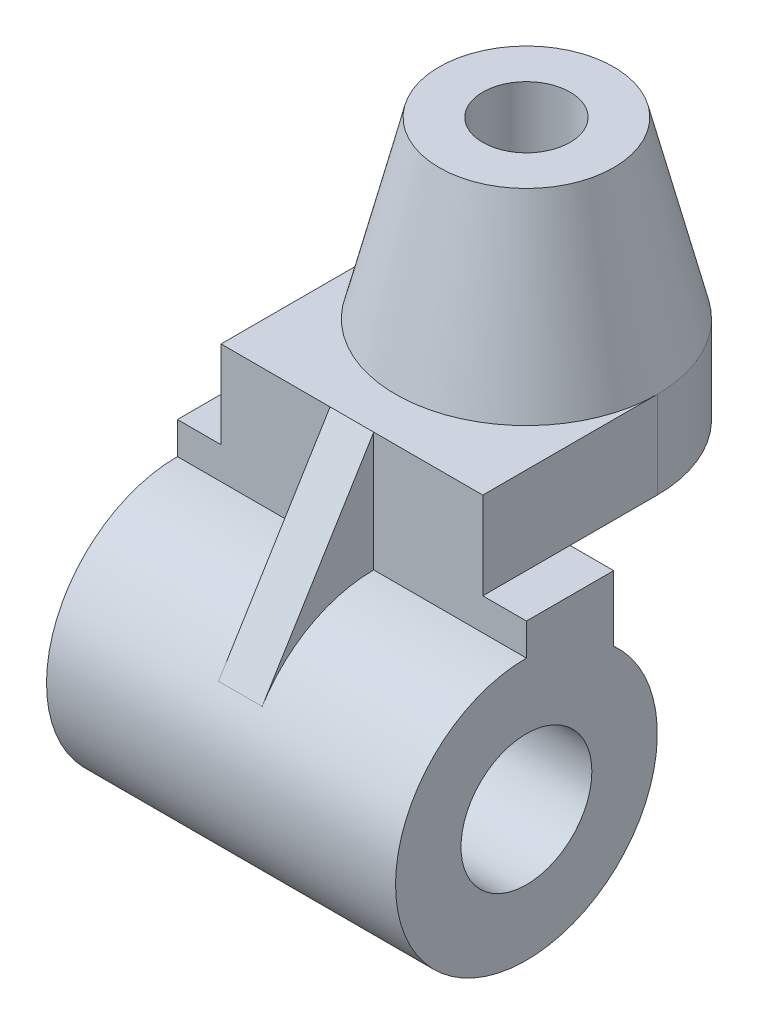
ISO-10303-21;
HEADER;
FILE_DESCRIPTION(('STEP AP214'),'2;1');
FILE_NAME('part.step','',(''),(''),'','','');
FILE_SCHEMA(('AUTOMOTIVE_DESIGN { 1 0 10303 214 1 1 1 1 }'));
ENDSEC;
DATA;
#1=APPLICATION_CONTEXT('core data for automotive mechanical design processes');
#2=APPLICATION_PROTOCOL_DEFINITION('international standard','automotive_design',2000,#1);
#3=PRODUCT_CONTEXT('',#1,'mechanical');
#4=PRODUCT('Part','Part','',(#3));
#5=PRODUCT_RELATED_PRODUCT_CATEGORY('part','',(#4));
#6=PRODUCT_DEFINITION_FORMATION('','',#4);
#7=PRODUCT_DEFINITION_CONTEXT('part definition',#1,'design');
#8=PRODUCT_DEFINITION('design','',#6,#7);
#9=PRODUCT_DEFINITION_SHAPE('','',#8);
#10=(LENGTH_UNIT() NAMED_UNIT(*) SI_UNIT(.MILLI.,.METRE.));
#11=(NAMED_UNIT(*) PLANE_ANGLE_UNIT() SI_UNIT($,.RADIAN.));
#12=(NAMED_UNIT(*) SI_UNIT($,.STERADIAN.) SOLID_ANGLE_UNIT());
#13=UNCERTAINTY_MEASURE_WITH_UNIT(LENGTH_MEASURE(1.E-05),#10,'distance_accuracy_value','');
#14=(GEOMETRIC_REPRESENTATION_CONTEXT(3) GLOBAL_UNCERTAINTY_ASSIGNED_CONTEXT((#13)) GLOBAL_UNIT_ASSIGNED_CONTEXT((#10,
#11,#12)) REPRESENTATION_CONTEXT('',''));
#15=CARTESIAN_POINT('',(0.,0.,0.));
#16=DIRECTION('',(0.,0.,1.));
#17=DIRECTION('',(1.,0.,0.));
#18=AXIS2_PLACEMENT_3D('',#15,#16,#17);
#19=CARTESIAN_POINT('',(0.,-60.,40.));
#20=DIRECTION('',(0.,0.,1.));
#21=DIRECTION('',(1.,0.,0.));
#22=AXIS2_PLACEMENT_3D('',#19,#20,#21);
#23=PLANE('',#22);
#24=DIRECTION('',(-1.,0.,0.));
#25=VECTOR('',#24,1.);
#26=CARTESIAN_POINT('',(40.,-67.3606797749979,40.));
#27=LINE('',#26,#25);
#28=CARTESIAN_POINT('',(-5.,-67.3606797749979,40.));
#29=VERTEX_POINT('',#28);
#30=CARTESIAN_POINT('',(-40.,-67.3606797749979,40.));
#31=VERTEX_POINT('',#30);
#32=EDGE_CURVE('E189',#29,#31,#27,.T.);
#33=ORIENTED_EDGE('',*,*,#32,.F.);
#34=DIRECTION('',(0.,1.,0.));
#35=VECTOR('',#34,1.);
#36=CARTESIAN_POINT('',(-5.,-60.,40.));
#37=LINE('',#36,#35);
#38=CARTESIAN_POINT('',(-5.,-40.,40.));
#39=VERTEX_POINT('',#38);
#40=EDGE_CURVE('E64',#29,#39,#37,.T.);
#41=ORIENTED_EDGE('',*,*,#40,.T.);
#42=DIRECTION('',(1.,0.,0.));
#43=VECTOR('',#42,1.);
#44=CARTESIAN_POINT('',(0.,-40.,40.));
#45=LINE('',#44,#43);
#46=CARTESIAN_POINT('',(-30.,-40.,40.));
#47=VERTEX_POINT('',#46);
#48=EDGE_CURVE('E215',#47,#39,#45,.T.);
#49=ORIENTED_EDGE('',*,*,#48,.F.);
#50=DIRECTION('',(0.,1.,0.));
#51=VECTOR('',#50,1.);
#52=CARTESIAN_POINT('',(-30.,-60.,40.));
#53=LINE('',#52,#51);
#54=CARTESIAN_POINT('',(-30.,-60.,40.));
#55=VERTEX_POINT('',#54);
#56=EDGE_CURVE('E224',#55,#47,#53,.T.);
#57=ORIENTED_EDGE('',*,*,#56,.F.);
#58=DIRECTION('',(-1.,0.,0.));
#59=VECTOR('',#58,1.);
#60=CARTESIAN_POINT('',(40.,-60.,40.));
#61=LINE('',#60,#59);
#62=CARTESIAN_POINT('',(-40.,-60.,40.));
#63=VERTEX_POINT('',#62);
#64=EDGE_CURVE('E192',#55,#63,#61,.T.);
#65=ORIENTED_EDGE('',*,*,#64,.T.);
#66=DIRECTION('',(0.,-1.,0.));
#67=VECTOR('',#66,1.);
#68=CARTESIAN_POINT('',(-40.,0.,40.));
#69=LINE('',#68,#67);
#70=EDGE_CURVE('E173',#63,#31,#69,.T.);
#71=ORIENTED_EDGE('',*,*,#70,.T.);
#72=EDGE_LOOP('',(#33,#41,#49,#57,#65,#71));
#73=FACE_BOUND('',#72,.T.);
#74=ADVANCED_FACE('F37',(#73),#23,.T.);
#75=CARTESIAN_POINT('',(0.,0.,0.));
#76=DIRECTION('',(0.,1.,0.));
#77=DIRECTION('',(0.,0.,1.));
#78=AXIS2_PLACEMENT_3D('',#75,#76,#77);
#79=PLANE('',#78);
#80=CARTESIAN_POINT('',(0.,0.,0.));
#81=DIRECTION('',(0.,1.,0.));
#82=DIRECTION('',(0.,0.,1.));
#83=AXIS2_PLACEMENT_3D('',#80,#81,#82);
#84=CIRCLE('',#83,10.);
#85=CARTESIAN_POINT('',(0.,0.,10.));
#86=VERTEX_POINT('',#85);
#87=EDGE_CURVE('E391',#86,#86,#84,.T.);
#88=ORIENTED_EDGE('',*,*,#87,.F.);
#89=EDGE_LOOP('',(#88));
#90=FACE_BOUND('',#89,.T.);
#91=CARTESIAN_POINT('',(0.,0.,0.));
#92=DIRECTION('',(0.,1.,0.));
#93=DIRECTION('',(0.,0.,1.));
#94=AXIS2_PLACEMENT_3D('',#91,#92,#93);
#95=CIRCLE('',#94,20.);
#96=CARTESIAN_POINT('',(0.,0.,20.));
#97=VERTEX_POINT('',#96);
#98=EDGE_CURVE('E42',#97,#97,#95,.T.);
#99=ORIENTED_EDGE('',*,*,#98,.T.);
#100=EDGE_LOOP('',(#99));
#101=FACE_BOUND('',#100,.T.);
#102=ADVANCED_FACE('F267',(#90,#101),#79,.T.);
#103=CARTESIAN_POINT('',(0.,0.,0.));
#104=DIRECTION('',(0.,-1.,0.));
#105=DIRECTION('',(0.,0.,-1.));
#106=AXIS2_PLACEMENT_3D('',#103,#104,#105);
#107=CONICAL_SURFACE('',#106,20.,0.244978663126864);
#108=CARTESIAN_POINT('',(0.,-40.,0.));
#109=DIRECTION('',(0.,1.,0.));
#110=DIRECTION('',(0.,0.,1.));
#111=AXIS2_PLACEMENT_3D('',#108,#109,#110);
#112=CIRCLE('',#111,30.);
#113=CARTESIAN_POINT('',(30.,-40.,0.000549099686691982));
#114=VERTEX_POINT('',#113);
#115=CARTESIAN_POINT('',(30.,-40.,0.));
#116=VERTEX_POINT('',#115);
#117=EDGE_CURVE('E234',#114,#116,#112,.T.);
#118=ORIENTED_EDGE('',*,*,#117,.T.);
#119=CARTESIAN_POINT('',(0.,-40.,0.));
#120=DIRECTION('',(0.,1.,0.));
#121=DIRECTION('',(0.,0.,1.));
#122=AXIS2_PLACEMENT_3D('',#119,#120,#121);
#123=CIRCLE('',#122,30.);
#124=CARTESIAN_POINT('',(-30.,-40.,0.));
#125=VERTEX_POINT('',#124);
#126=EDGE_CURVE('E202',#125,#116,#123,.F.);
#127=ORIENTED_EDGE('',*,*,#126,.F.);
#128=EDGE_CURVE('E238',#125,#114,#112,.T.);
#129=ORIENTED_EDGE('',*,*,#128,.T.);
#130=EDGE_LOOP('',(#118,#127,#129));
#131=FACE_BOUND('',#130,.T.);
#132=ORIENTED_EDGE('',*,*,#98,.F.);
#133=EDGE_LOOP('',(#132));
#134=FACE_BOUND('',#133,.T.);
#135=ADVANCED_FACE('F39',(#131,#134),#107,.T.);
#136=CARTESIAN_POINT('',(0.,-40.0001,0.));
#137=DIRECTION('',(0.,1.,0.));
#138=DIRECTION('',(0.,0.,1.));
#139=AXIS2_PLACEMENT_3D('',#136,#137,#138);
#140=CYLINDRICAL_SURFACE('',#139,10.);
#141=CARTESIAN_POINT('',(0.,-40.,0.));
#142=DIRECTION('',(0.,1.,0.));
#143=DIRECTION('',(0.,0.,1.));
#144=AXIS2_PLACEMENT_3D('',#141,#142,#143);
#145=CIRCLE('',#144,10.);
#146=CARTESIAN_POINT('',(0.,-40.,10.));
#147=VERTEX_POINT('',#146);
#148=EDGE_CURVE('E393',#147,#147,#145,.T.);
#149=ORIENTED_EDGE('',*,*,#148,.F.);
#150=EDGE_LOOP('',(#149));
#151=FACE_BOUND('',#150,.T.);
#152=ORIENTED_EDGE('',*,*,#87,.T.);
#153=EDGE_LOOP('',(#152));
#154=FACE_BOUND('',#153,.T.);
#155=ADVANCED_FACE('F277',(#151,#154),#140,.F.);
#156=CARTESIAN_POINT('',(0.,-40.,0.));
#157=DIRECTION('',(0.,1.,0.));
#158=DIRECTION('',(0.,0.,1.));
#159=AXIS2_PLACEMENT_3D('',#156,#157,#158);
#160=PLANE('',#159);
#161=ORIENTED_EDGE('',*,*,#148,.T.);
#162=EDGE_LOOP('',(#161));
#163=FACE_BOUND('',#162,.T.);
#164=ADVANCED_FACE('F280',(#163),#160,.T.);
#165=CARTESIAN_POINT('',(0.,-60.,0.));
#166=DIRECTION('',(0.,1.,0.));
#167=DIRECTION('',(0.,0.,1.));
#168=AXIS2_PLACEMENT_3D('',#165,#166,#167);
#169=CYLINDRICAL_SURFACE('',#168,30.);
#170=DIRECTION('',(0.,1.,0.));
#171=VECTOR('',#170,1.);
#172=CARTESIAN_POINT('',(30.,-60.,0.));
#173=LINE('',#172,#171);
#174=CARTESIAN_POINT('',(30.,-60.,0.));
#175=VERTEX_POINT('',#174);
#176=EDGE_CURVE('E249',#175,#116,#173,.T.);
#177=ORIENTED_EDGE('',*,*,#176,.F.);
#178=CARTESIAN_POINT('',(0.,-60.,0.));
#179=DIRECTION('',(0.,1.,0.));
#180=DIRECTION('',(0.,0.,1.));
#181=AXIS2_PLACEMENT_3D('',#178,#179,#180);
#182=CIRCLE('',#181,30.);
#183=CARTESIAN_POINT('',(-30.,-60.,0.));
#184=VERTEX_POINT('',#183);
#185=EDGE_CURVE('E203',#184,#175,#182,.F.);
#186=ORIENTED_EDGE('',*,*,#185,.F.);
#187=DIRECTION('',(0.,1.,0.));
#188=VECTOR('',#187,1.);
#189=CARTESIAN_POINT('',(-30.,-60.,0.));
#190=LINE('',#189,#188);
#191=EDGE_CURVE('E214',#184,#125,#190,.T.);
#192=ORIENTED_EDGE('',*,*,#191,.T.);
#193=ORIENTED_EDGE('',*,*,#126,.T.);
#194=EDGE_LOOP('',(#177,#186,#192,#193));
#195=FACE_BOUND('',#194,.T.);
#196=ADVANCED_FACE('F282',(#195),#169,.T.);
#197=CARTESIAN_POINT('',(30.,-60.,0.));
#198=DIRECTION('',(1.,0.,0.));
#199=DIRECTION('',(0.,0.,-1.));
#200=AXIS2_PLACEMENT_3D('',#197,#198,#199);
#201=PLANE('',#200);
#202=DIRECTION('',(0.,0.,-1.));
#203=VECTOR('',#202,1.);
#204=CARTESIAN_POINT('',(30.,-40.,0.));
#205=LINE('',#204,#203);
#206=CARTESIAN_POINT('',(30.,-40.,40.));
#207=VERTEX_POINT('',#206);
#208=EDGE_CURVE('E206',#207,#114,#205,.T.);
#209=ORIENTED_EDGE('',*,*,#208,.F.);
#210=DIRECTION('',(0.,1.,0.));
#211=VECTOR('',#210,1.);
#212=CARTESIAN_POINT('',(30.,-60.,40.));
#213=LINE('',#212,#211);
#214=CARTESIAN_POINT('',(30.,-60.,40.));
#215=VERTEX_POINT('',#214);
#216=EDGE_CURVE('E219',#215,#207,#213,.T.);
#217=ORIENTED_EDGE('',*,*,#216,.F.);
#218=DIRECTION('',(0.,0.,-1.));
#219=VECTOR('',#218,1.);
#220=CARTESIAN_POINT('',(30.,-60.,0.));
#221=LINE('',#220,#219);
#222=CARTESIAN_POINT('',(30.,-60.,20.));
#223=VERTEX_POINT('',#222);
#224=EDGE_CURVE('E211',#215,#223,#221,.T.);
#225=ORIENTED_EDGE('',*,*,#224,.T.);
#226=EDGE_CURVE('E210',#223,#175,#221,.T.);
#227=ORIENTED_EDGE('',*,*,#226,.T.);
#228=ORIENTED_EDGE('',*,*,#176,.T.);
#229=ORIENTED_EDGE('',*,*,#117,.F.);
#230=EDGE_LOOP('',(#209,#217,#225,#227,#228,#229));
#231=FACE_BOUND('',#230,.T.);
#232=ADVANCED_FACE('F286',(#231),#201,.T.);
#233=DIRECTION('',(0.,1.,0.));
#234=VECTOR('',#233,1.);
#235=CARTESIAN_POINT('',(5.,-60.,40.));
#236=LINE('',#235,#234);
#237=CARTESIAN_POINT('',(5.,-67.3606797749979,40.));
#238=VERTEX_POINT('',#237);
#239=CARTESIAN_POINT('',(5.,-40.,40.));
#240=VERTEX_POINT('',#239);
#241=EDGE_CURVE('E157',#238,#240,#236,.T.);
#242=ORIENTED_EDGE('',*,*,#241,.F.);
#243=CARTESIAN_POINT('',(40.,-67.3606797749979,40.));
#244=VERTEX_POINT('',#243);
#245=EDGE_CURVE('E190',#244,#238,#27,.T.);
#246=ORIENTED_EDGE('',*,*,#245,.F.);
#247=DIRECTION('',(0.,-1.,0.));
#248=VECTOR('',#247,1.);
#249=CARTESIAN_POINT('',(40.,0.,40.));
#250=LINE('',#249,#248);
#251=CARTESIAN_POINT('',(40.,-60.,40.));
#252=VERTEX_POINT('',#251);
#253=EDGE_CURVE('E187',#252,#244,#250,.T.);
#254=ORIENTED_EDGE('',*,*,#253,.F.);
#255=EDGE_CURVE('E193',#252,#215,#61,.T.);
#256=ORIENTED_EDGE('',*,*,#255,.T.);
#257=ORIENTED_EDGE('',*,*,#216,.T.);
#258=EDGE_CURVE('E56',#240,#207,#45,.T.);
#259=ORIENTED_EDGE('',*,*,#258,.F.);
#260=EDGE_LOOP('',(#242,#246,#254,#256,#257,#259));
#261=FACE_BOUND('',#260,.T.);
#262=ADVANCED_FACE('F314',(#261),#23,.T.);
#263=CARTESIAN_POINT('',(-30.,-60.,0.));
#264=DIRECTION('',(-1.,0.,0.));
#265=DIRECTION('',(0.,0.,1.));
#266=AXIS2_PLACEMENT_3D('',#263,#264,#265);
#267=PLANE('',#266);
#268=DIRECTION('',(0.,0.,1.));
#269=VECTOR('',#268,1.);
#270=CARTESIAN_POINT('',(-30.,-40.,0.));
#271=LINE('',#270,#269);
#272=EDGE_CURVE('E231',#125,#47,#271,.T.);
#273=ORIENTED_EDGE('',*,*,#272,.F.);
#274=ORIENTED_EDGE('',*,*,#191,.F.);
#275=DIRECTION('',(0.,0.,1.));
#276=VECTOR('',#275,1.);
#277=CARTESIAN_POINT('',(-30.,-60.,0.));
#278=LINE('',#277,#276);
#279=CARTESIAN_POINT('',(-30.,-60.,20.));
#280=VERTEX_POINT('',#279);
#281=EDGE_CURVE('E207',#184,#280,#278,.T.);
#282=ORIENTED_EDGE('',*,*,#281,.T.);
#283=EDGE_CURVE('E205',#280,#55,#278,.T.);
#284=ORIENTED_EDGE('',*,*,#283,.T.);
#285=ORIENTED_EDGE('',*,*,#56,.T.);
#286=EDGE_LOOP('',(#273,#274,#282,#284,#285));
#287=FACE_BOUND('',#286,.T.);
#288=ADVANCED_FACE('F288',(#287),#267,.T.);
#289=CARTESIAN_POINT('',(0.,-60.,0.));
#290=DIRECTION('',(0.,1.,0.));
#291=DIRECTION('',(0.,0.,1.));
#292=AXIS2_PLACEMENT_3D('',#289,#290,#291);
#293=PLANE('',#292);
#294=DIRECTION('',(-1.,0.,0.));
#295=VECTOR('',#294,1.);
#296=CARTESIAN_POINT('',(40.,-60.,20.));
#297=LINE('',#296,#295);
#298=EDGE_CURVE('E48',#223,#280,#297,.T.);
#299=ORIENTED_EDGE('',*,*,#298,.T.);
#300=ORIENTED_EDGE('',*,*,#281,.F.);
#301=ORIENTED_EDGE('',*,*,#185,.T.);
#302=ORIENTED_EDGE('',*,*,#226,.F.);
#303=EDGE_LOOP('',(#299,#300,#301,#302));
#304=FACE_BOUND('',#303,.T.);
#305=ADVANCED_FACE('F322',(#304),#293,.F.);
#306=ORIENTED_EDGE('',*,*,#208,.T.);
#307=ORIENTED_EDGE('',*,*,#128,.F.);
#308=ORIENTED_EDGE('',*,*,#272,.T.);
#309=ORIENTED_EDGE('',*,*,#48,.T.);
#310=DIRECTION('',(1.,0.,0.));
#311=VECTOR('',#310,1.);
#312=CARTESIAN_POINT('',(0.,-40.,40.));
#313=LINE('',#312,#311);
#314=EDGE_CURVE('E151',#39,#240,#313,.T.);
#315=ORIENTED_EDGE('',*,*,#314,.T.);
#316=ORIENTED_EDGE('',*,*,#258,.T.);
#317=EDGE_LOOP('',(#306,#307,#308,#309,#315,#316));
#318=FACE_BOUND('',#317,.T.);
#319=ADVANCED_FACE('F316',(#318),#160,.T.);
#320=CARTESIAN_POINT('',(40.,-60.,0.));
#321=DIRECTION('',(0.,1.,0.));
#322=DIRECTION('',(0.,0.,1.));
#323=AXIS2_PLACEMENT_3D('',#320,#321,#322);
#324=PLANE('',#323);
#325=ORIENTED_EDGE('',*,*,#224,.F.);
#326=ORIENTED_EDGE('',*,*,#255,.F.);
#327=DIRECTION('',(0.,0.,-1.));
#328=VECTOR('',#327,1.);
#329=CARTESIAN_POINT('',(40.,-60.,0.));
#330=LINE('',#329,#328);
#331=CARTESIAN_POINT('',(40.,-60.,20.));
#332=VERTEX_POINT('',#331);
#333=EDGE_CURVE('E184',#252,#332,#330,.T.);
#334=ORIENTED_EDGE('',*,*,#333,.T.);
#335=EDGE_CURVE('E197',#332,#223,#297,.T.);
#336=ORIENTED_EDGE('',*,*,#335,.T.);
#337=EDGE_LOOP('',(#325,#326,#334,#336));
#338=FACE_BOUND('',#337,.T.);
#339=ADVANCED_FACE('F363',(#338),#324,.T.);
#340=ORIENTED_EDGE('',*,*,#283,.F.);
#341=CARTESIAN_POINT('',(-40.,-60.,20.));
#342=VERTEX_POINT('',#341);
#343=EDGE_CURVE('E196',#280,#342,#297,.T.);
#344=ORIENTED_EDGE('',*,*,#343,.T.);
#345=DIRECTION('',(0.,0.,-1.));
#346=VECTOR('',#345,1.);
#347=CARTESIAN_POINT('',(-40.,-60.,0.));
#348=LINE('',#347,#346);
#349=EDGE_CURVE('E170',#63,#342,#348,.T.);
#350=ORIENTED_EDGE('',*,*,#349,.F.);
#351=ORIENTED_EDGE('',*,*,#64,.F.);
#352=EDGE_LOOP('',(#340,#344,#350,#351));
#353=FACE_BOUND('',#352,.T.);
#354=ADVANCED_FACE('F366',(#353),#324,.T.);
#355=CARTESIAN_POINT('',(40.,-97.3606797749979,40.));
#356=DIRECTION('',(-1.,0.,0.));
#357=DIRECTION('',(0.,0.,1.));
#358=AXIS2_PLACEMENT_3D('',#355,#356,#357);
#359=CYLINDRICAL_SURFACE('',#358,30.);
#360=CARTESIAN_POINT('',(5.,-97.3606797749979,40.));
#361=DIRECTION('',(1.,0.,0.));
#362=DIRECTION('',(0.,0.,-1.));
#363=AXIS2_PLACEMENT_3D('',#360,#361,#362);
#364=CIRCLE('',#363,30.);
#365=CARTESIAN_POINT('',(5.,-81.6704891508573,65.5698634759385));
#366=VERTEX_POINT('',#365);
#367=EDGE_CURVE('E138',#238,#366,#364,.T.);
#368=ORIENTED_EDGE('',*,*,#367,.T.);
#369=DIRECTION('',(-1.,0.,0.));
#370=VECTOR('',#369,1.);
#371=CARTESIAN_POINT('',(40.,-81.6704891508573,65.5698634759385));
#372=LINE('',#371,#370);
#373=CARTESIAN_POINT('',(-5.,-81.6704891508573,65.5698634759385));
#374=VERTEX_POINT('',#373);
#375=EDGE_CURVE('E12',#366,#374,#372,.T.);
#376=ORIENTED_EDGE('',*,*,#375,.T.);
#377=CARTESIAN_POINT('',(-5.,-97.3606797749979,40.));
#378=DIRECTION('',(1.,0.,0.));
#379=DIRECTION('',(0.,0.,-1.));
#380=AXIS2_PLACEMENT_3D('',#377,#378,#379);
#381=CIRCLE('',#380,30.);
#382=EDGE_CURVE('E135',#29,#374,#381,.T.);
#383=ORIENTED_EDGE('',*,*,#382,.F.);
#384=ORIENTED_EDGE('',*,*,#32,.T.);
#385=CARTESIAN_POINT('',(-40.,-97.3606797749979,40.));
#386=DIRECTION('',(1.,0.,0.));
#387=DIRECTION('',(0.,0.,-1.));
#388=AXIS2_PLACEMENT_3D('',#385,#386,#387);
#389=CIRCLE('',#388,30.);
#390=CARTESIAN_POINT('',(-40.,-75.,20.));
#391=VERTEX_POINT('',#390);
#392=EDGE_CURVE('E164',#31,#391,#389,.T.);
#393=ORIENTED_EDGE('',*,*,#392,.T.);
#394=DIRECTION('',(-1.,0.,0.));
#395=VECTOR('',#394,1.);
#396=CARTESIAN_POINT('',(40.,-75.,20.));
#397=LINE('',#396,#395);
#398=CARTESIAN_POINT('',(40.,-75.,20.));
#399=VERTEX_POINT('',#398);
#400=EDGE_CURVE('E200',#399,#391,#397,.T.);
#401=ORIENTED_EDGE('',*,*,#400,.F.);
#402=CARTESIAN_POINT('',(40.,-97.3606797749979,40.));
#403=DIRECTION('',(1.,0.,0.));
#404=DIRECTION('',(0.,0.,-1.));
#405=AXIS2_PLACEMENT_3D('',#402,#403,#404);
#406=CIRCLE('',#405,30.);
#407=EDGE_CURVE('E179',#244,#399,#406,.T.);
#408=ORIENTED_EDGE('',*,*,#407,.F.);
#409=ORIENTED_EDGE('',*,*,#245,.T.);
#410=EDGE_LOOP('',(#368,#376,#383,#384,#393,#401,#408,#409));
#411=FACE_BOUND('',#410,.T.);
#412=ADVANCED_FACE('F134',(#411),#359,.T.);
#413=CARTESIAN_POINT('',(40.,0.,20.));
#414=DIRECTION('',(0.,0.,-1.));
#415=DIRECTION('',(-1.,0.,0.));
#416=AXIS2_PLACEMENT_3D('',#413,#414,#415);
#417=PLANE('',#416);
#418=ORIENTED_EDGE('',*,*,#400,.T.);
#419=DIRECTION('',(0.,-1.,0.));
#420=VECTOR('',#419,1.);
#421=CARTESIAN_POINT('',(-40.,0.,20.));
#422=LINE('',#421,#420);
#423=EDGE_CURVE('E167',#342,#391,#422,.T.);
#424=ORIENTED_EDGE('',*,*,#423,.F.);
#425=ORIENTED_EDGE('',*,*,#343,.F.);
#426=ORIENTED_EDGE('',*,*,#298,.F.);
#427=ORIENTED_EDGE('',*,*,#335,.F.);
#428=DIRECTION('',(0.,-1.,0.));
#429=VECTOR('',#428,1.);
#430=CARTESIAN_POINT('',(40.,0.,20.));
#431=LINE('',#430,#429);
#432=EDGE_CURVE('E181',#332,#399,#431,.T.);
#433=ORIENTED_EDGE('',*,*,#432,.T.);
#434=EDGE_LOOP('',(#418,#424,#425,#426,#427,#433));
#435=FACE_BOUND('',#434,.T.);
#436=ADVANCED_FACE('F336',(#435),#417,.T.);
#437=CARTESIAN_POINT('',(40.,-97.3606797749979,40.));
#438=DIRECTION('',(-1.,0.,0.));
#439=DIRECTION('',(0.,0.,1.));
#440=AXIS2_PLACEMENT_3D('',#437,#438,#439);
#441=CYLINDRICAL_SURFACE('',#440,15.);
#442=CARTESIAN_POINT('',(40.,-97.3606797749979,40.));
#443=DIRECTION('',(1.,0.,0.));
#444=DIRECTION('',(0.,0.,-1.));
#445=AXIS2_PLACEMENT_3D('',#442,#443,#444);
#446=CIRCLE('',#445,15.);
#447=CARTESIAN_POINT('',(40.,-97.3606797749979,25.));
#448=VERTEX_POINT('',#447);
#449=EDGE_CURVE('E176',#448,#448,#446,.T.);
#450=ORIENTED_EDGE('',*,*,#449,.T.);
#451=EDGE_LOOP('',(#450));
#452=FACE_BOUND('',#451,.T.);
#453=CARTESIAN_POINT('',(-40.,-97.3606797749979,40.));
#454=DIRECTION('',(1.,0.,0.));
#455=DIRECTION('',(0.,0.,-1.));
#456=AXIS2_PLACEMENT_3D('',#453,#454,#455);
#457=CIRCLE('',#456,15.);
#458=CARTESIAN_POINT('',(-40.,-97.3606797749979,25.));
#459=VERTEX_POINT('',#458);
#460=EDGE_CURVE('E161',#459,#459,#457,.T.);
#461=ORIENTED_EDGE('',*,*,#460,.F.);
#462=EDGE_LOOP('',(#461));
#463=FACE_BOUND('',#462,.T.);
#464=ADVANCED_FACE('F361',(#452,#463),#441,.F.);
#465=CARTESIAN_POINT('',(40.,0.,0.));
#466=DIRECTION('',(1.,0.,0.));
#467=DIRECTION('',(0.,0.,-1.));
#468=AXIS2_PLACEMENT_3D('',#465,#466,#467);
#469=PLANE('',#468);
#470=ORIENTED_EDGE('',*,*,#449,.F.);
#471=EDGE_LOOP('',(#470));
#472=FACE_BOUND('',#471,.T.);
#473=ORIENTED_EDGE('',*,*,#407,.T.);
#474=ORIENTED_EDGE('',*,*,#432,.F.);
#475=ORIENTED_EDGE('',*,*,#333,.F.);
#476=ORIENTED_EDGE('',*,*,#253,.T.);
#477=EDGE_LOOP('',(#473,#474,#475,#476));
#478=FACE_BOUND('',#477,.T.);
#479=ADVANCED_FACE('F342',(#472,#478),#469,.T.);
#480=CARTESIAN_POINT('',(-40.,0.,0.));
#481=DIRECTION('',(1.,0.,0.));
#482=DIRECTION('',(0.,0.,-1.));
#483=AXIS2_PLACEMENT_3D('',#480,#481,#482);
#484=PLANE('',#483);
#485=ORIENTED_EDGE('',*,*,#460,.T.);
#486=EDGE_LOOP('',(#485));
#487=FACE_BOUND('',#486,.T.);
#488=ORIENTED_EDGE('',*,*,#392,.F.);
#489=ORIENTED_EDGE('',*,*,#70,.F.);
#490=ORIENTED_EDGE('',*,*,#349,.T.);
#491=ORIENTED_EDGE('',*,*,#423,.T.);
#492=EDGE_LOOP('',(#488,#489,#490,#491));
#493=FACE_BOUND('',#492,.T.);
#494=ADVANCED_FACE('F331',(#487,#493),#484,.F.);
#495=CARTESIAN_POINT('',(0.,-40.,40.));
#496=DIRECTION('',(0.,0.523006354138018,0.852328782531282));
#497=DIRECTION('',(0.,-0.852328782531282,0.523006354138018));
#498=AXIS2_PLACEMENT_3D('',#495,#496,#497);
#499=PLANE('',#498);
#500=ORIENTED_EDGE('',*,*,#314,.F.);
#501=DIRECTION('',(0.,-0.852328782531282,0.523006354138018));
#502=VECTOR('',#501,1.);
#503=CARTESIAN_POINT('',(-5.,-40.,40.));
#504=LINE('',#503,#502);
#505=EDGE_CURVE('E146',#39,#374,#504,.T.);
#506=ORIENTED_EDGE('',*,*,#505,.T.);
#507=ORIENTED_EDGE('',*,*,#375,.F.);
#508=DIRECTION('',(0.,-0.852328782531282,0.523006354138018));
#509=VECTOR('',#508,1.);
#510=CARTESIAN_POINT('',(5.,-40.,40.));
#511=LINE('',#510,#509);
#512=EDGE_CURVE('E147',#240,#366,#511,.T.);
#513=ORIENTED_EDGE('',*,*,#512,.F.);
#514=EDGE_LOOP('',(#500,#506,#507,#513));
#515=FACE_BOUND('',#514,.T.);
#516=ADVANCED_FACE('F150',(#515),#499,.T.);
#517=CARTESIAN_POINT('',(5.,-63.6802898874989,19.99995));
#518=DIRECTION('',(1.,0.,0.));
#519=DIRECTION('',(0.,0.,-1.));
#520=AXIS2_PLACEMENT_3D('',#517,#518,#519);
#521=PLANE('',#520);
#522=ORIENTED_EDGE('',*,*,#367,.F.);
#523=ORIENTED_EDGE('',*,*,#241,.T.);
#524=ORIENTED_EDGE('',*,*,#512,.T.);
#525=EDGE_LOOP('',(#522,#523,#524));
#526=FACE_BOUND('',#525,.T.);
#527=ADVANCED_FACE('F346',(#526),#521,.T.);
#528=CARTESIAN_POINT('',(-5.,-63.6802898874989,19.99995));
#529=DIRECTION('',(1.,0.,0.));
#530=DIRECTION('',(0.,0.,-1.));
#531=AXIS2_PLACEMENT_3D('',#528,#529,#530);
#532=PLANE('',#531);
#533=ORIENTED_EDGE('',*,*,#40,.F.);
#534=ORIENTED_EDGE('',*,*,#382,.T.);
#535=ORIENTED_EDGE('',*,*,#505,.F.);
#536=EDGE_LOOP('',(#533,#534,#535));
#537=FACE_BOUND('',#536,.T.);
#538=ADVANCED_FACE('F145',(#537),#532,.F.);
#539=CLOSED_SHELL('',(#74,#102,#135,#155,#164,#196,#232,#262,#288,#305,#319,#339,#354,#412,#436,
#464,#479,#494,#516,#527,#538));
#540=MANIFOLD_SOLID_BREP('B2',#539);
#541=ADVANCED_BREP_SHAPE_REPRESENTATION('',(#18,#540),#14);
#542=SHAPE_DEFINITION_REPRESENTATION(#9,#541);
ENDSEC;
END-ISO-10303-21;
